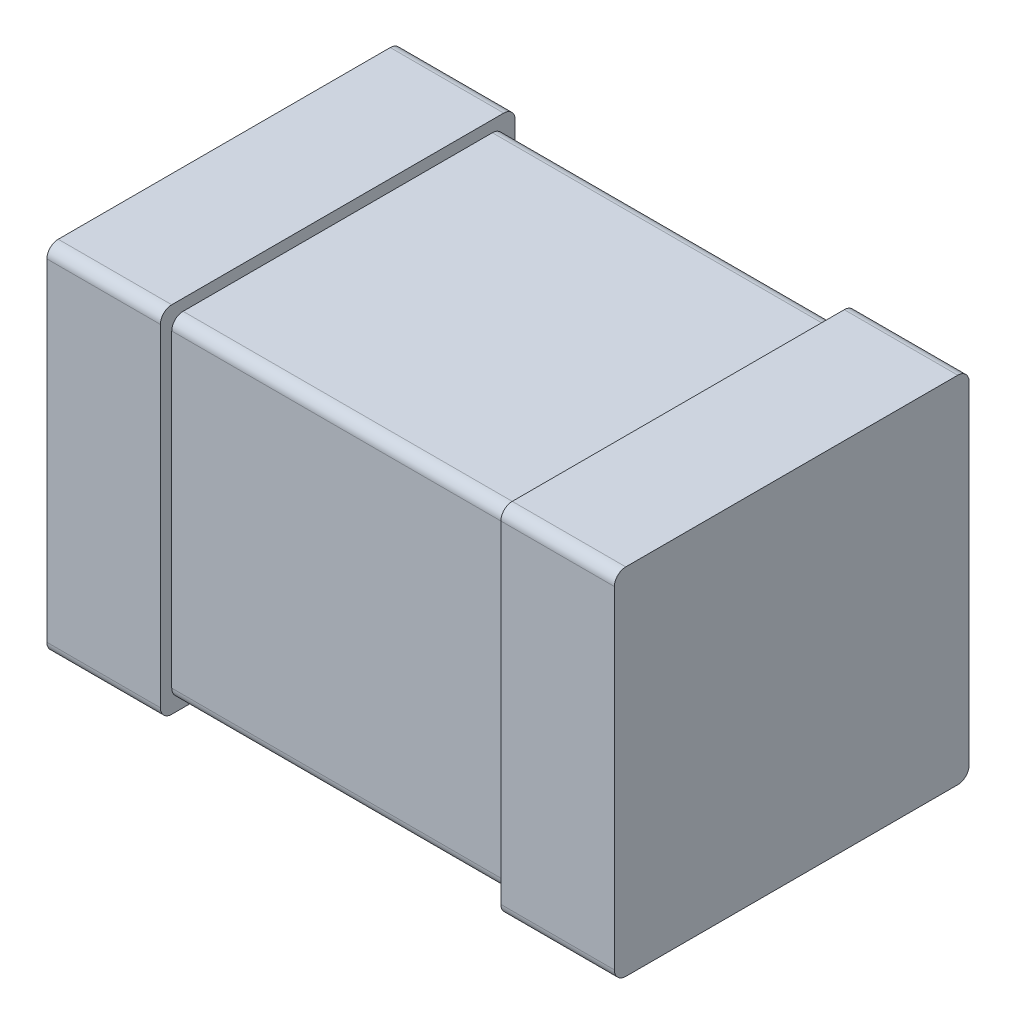
ISO-10303-21;
HEADER;
FILE_DESCRIPTION(('STEP AP214'),'2;1');
FILE_NAME('part.step','',(''),(''),'','','');
FILE_SCHEMA(('AUTOMOTIVE_DESIGN { 1 0 10303 214 1 1 1 1 }'));
ENDSEC;
DATA;
#1=APPLICATION_CONTEXT('core data for automotive mechanical design processes');
#2=APPLICATION_PROTOCOL_DEFINITION('international standard','automotive_design',2000,#1);
#3=PRODUCT_CONTEXT('',#1,'mechanical');
#4=PRODUCT('Part','Part','',(#3));
#5=PRODUCT_RELATED_PRODUCT_CATEGORY('part','',(#4));
#6=PRODUCT_DEFINITION_FORMATION('','',#4);
#7=PRODUCT_DEFINITION_CONTEXT('part definition',#1,'design');
#8=PRODUCT_DEFINITION('design','',#6,#7);
#9=PRODUCT_DEFINITION_SHAPE('','',#8);
#10=(LENGTH_UNIT() NAMED_UNIT(*) SI_UNIT(.MILLI.,.METRE.));
#11=(NAMED_UNIT(*) PLANE_ANGLE_UNIT() SI_UNIT($,.RADIAN.));
#12=(NAMED_UNIT(*) SI_UNIT($,.STERADIAN.) SOLID_ANGLE_UNIT());
#13=UNCERTAINTY_MEASURE_WITH_UNIT(LENGTH_MEASURE(1.E-05),#10,'distance_accuracy_value','');
#14=(GEOMETRIC_REPRESENTATION_CONTEXT(3) GLOBAL_UNCERTAINTY_ASSIGNED_CONTEXT((#13)) GLOBAL_UNIT_ASSIGNED_CONTEXT((#10,
#11,#12)) REPRESENTATION_CONTEXT('',''));
#15=CARTESIAN_POINT('',(0.,0.,0.));
#16=DIRECTION('',(0.,0.,1.));
#17=DIRECTION('',(1.,0.,0.));
#18=AXIS2_PLACEMENT_3D('',#15,#16,#17);
#19=CARTESIAN_POINT('',(-1.,-0.625,0.));
#20=DIRECTION('',(1.,0.,0.));
#21=DIRECTION('',(0.,1.,0.));
#22=AXIS2_PLACEMENT_3D('',#19,#20,#21);
#23=PLANE('',#22);
#24=CARTESIAN_POINT('',(-1.,-0.585,1.21));
#25=DIRECTION('',(-1.,0.,0.));
#26=DIRECTION('',(0.,0.,1.));
#27=AXIS2_PLACEMENT_3D('',#24,#25,#26);
#28=CIRCLE('',#27,0.04);
#29=CARTESIAN_POINT('',(-1.,-0.625,1.21));
#30=VERTEX_POINT('',#29);
#31=CARTESIAN_POINT('',(-1.,-0.585,1.25));
#32=VERTEX_POINT('',#31);
#33=EDGE_CURVE('E11',#30,#32,#28,.T.);
#34=ORIENTED_EDGE('',*,*,#33,.T.);
#35=DIRECTION('',(0.,1.,0.));
#36=VECTOR('',#35,1.);
#37=CARTESIAN_POINT('',(-1.,-0.625,1.25));
#38=LINE('',#37,#36);
#39=CARTESIAN_POINT('',(-1.,0.585,1.25));
#40=VERTEX_POINT('',#39);
#41=EDGE_CURVE('E27',#32,#40,#38,.T.);
#42=ORIENTED_EDGE('',*,*,#41,.T.);
#43=CARTESIAN_POINT('',(-1.,0.585,1.21));
#44=DIRECTION('',(1.,0.,0.));
#45=DIRECTION('',(0.,0.,1.));
#46=AXIS2_PLACEMENT_3D('',#43,#44,#45);
#47=CIRCLE('',#46,0.04);
#48=CARTESIAN_POINT('',(-1.,0.625,1.21));
#49=VERTEX_POINT('',#48);
#50=EDGE_CURVE('E312',#49,#40,#47,.T.);
#51=ORIENTED_EDGE('',*,*,#50,.F.);
#52=DIRECTION('',(0.,0.,1.));
#53=VECTOR('',#52,1.);
#54=CARTESIAN_POINT('',(-1.,0.625,0.));
#55=LINE('',#54,#53);
#56=CARTESIAN_POINT('',(-1.,0.625,0.04));
#57=VERTEX_POINT('',#56);
#58=EDGE_CURVE('E278',#57,#49,#55,.T.);
#59=ORIENTED_EDGE('',*,*,#58,.F.);
#60=CARTESIAN_POINT('',(-1.,0.585,0.04));
#61=DIRECTION('',(-1.,0.,0.));
#62=DIRECTION('',(0.,0.,1.));
#63=AXIS2_PLACEMENT_3D('',#60,#61,#62);
#64=CIRCLE('',#63,0.04);
#65=CARTESIAN_POINT('',(-1.,0.585,0.));
#66=VERTEX_POINT('',#65);
#67=EDGE_CURVE('E328',#57,#66,#64,.T.);
#68=ORIENTED_EDGE('',*,*,#67,.T.);
#69=DIRECTION('',(0.,1.,0.));
#70=VECTOR('',#69,1.);
#71=CARTESIAN_POINT('',(-1.,-0.625,0.));
#72=LINE('',#71,#70);
#73=CARTESIAN_POINT('',(-1.,-0.585,0.));
#74=VERTEX_POINT('',#73);
#75=EDGE_CURVE('E304',#74,#66,#72,.T.);
#76=ORIENTED_EDGE('',*,*,#75,.F.);
#77=CARTESIAN_POINT('',(-1.,-0.585,0.04));
#78=DIRECTION('',(1.,0.,0.));
#79=DIRECTION('',(0.,0.,1.));
#80=AXIS2_PLACEMENT_3D('',#77,#78,#79);
#81=CIRCLE('',#80,0.04);
#82=CARTESIAN_POINT('',(-1.,-0.625,0.04));
#83=VERTEX_POINT('',#82);
#84=EDGE_CURVE('E248',#83,#74,#81,.T.);
#85=ORIENTED_EDGE('',*,*,#84,.F.);
#86=DIRECTION('',(0.,0.,1.));
#87=VECTOR('',#86,1.);
#88=CARTESIAN_POINT('',(-1.,-0.625,0.));
#89=LINE('',#88,#87);
#90=EDGE_CURVE('E231',#83,#30,#89,.T.);
#91=ORIENTED_EDGE('',*,*,#90,.T.);
#92=EDGE_LOOP('',(#34,#42,#51,#59,#68,#76,#85,#91));
#93=FACE_BOUND('',#92,.T.);
#94=ADVANCED_FACE('F16',(#93),#23,.F.);
#95=CARTESIAN_POINT('',(-1.,-0.625,0.));
#96=DIRECTION('',(0.,1.,0.));
#97=DIRECTION('',(1.,0.,0.));
#98=AXIS2_PLACEMENT_3D('',#95,#96,#97);
#99=PLANE('',#98);
#100=DIRECTION('',(1.,0.,0.));
#101=VECTOR('',#100,1.);
#102=CARTESIAN_POINT('',(-1.,-0.625,1.21));
#103=LINE('',#102,#101);
#104=CARTESIAN_POINT('',(-0.6,-0.625,1.21));
#105=VERTEX_POINT('',#104);
#106=EDGE_CURVE('E239',#30,#105,#103,.T.);
#107=ORIENTED_EDGE('',*,*,#106,.F.);
#108=ORIENTED_EDGE('',*,*,#90,.F.);
#109=DIRECTION('',(1.,0.,0.));
#110=VECTOR('',#109,1.);
#111=CARTESIAN_POINT('',(-1.,-0.625,0.04));
#112=LINE('',#111,#110);
#113=CARTESIAN_POINT('',(-0.6,-0.625,0.04));
#114=VERTEX_POINT('',#113);
#115=EDGE_CURVE('E228',#83,#114,#112,.T.);
#116=ORIENTED_EDGE('',*,*,#115,.T.);
#117=DIRECTION('',(0.,0.,1.));
#118=VECTOR('',#117,1.);
#119=CARTESIAN_POINT('',(-0.6,-0.625,0.));
#120=LINE('',#119,#118);
#121=EDGE_CURVE('E232',#114,#105,#120,.T.);
#122=ORIENTED_EDGE('',*,*,#121,.T.);
#123=EDGE_LOOP('',(#107,#108,#116,#122));
#124=FACE_BOUND('',#123,.T.);
#125=ADVANCED_FACE('F553',(#124),#99,.F.);
#126=CARTESIAN_POINT('',(-1.,-0.585,0.04));
#127=DIRECTION('',(1.,0.,0.));
#128=DIRECTION('',(0.,-1.,0.));
#129=AXIS2_PLACEMENT_3D('',#126,#127,#128);
#130=CYLINDRICAL_SURFACE('',#129,0.04);
#131=ORIENTED_EDGE('',*,*,#84,.T.);
#132=DIRECTION('',(1.,0.,0.));
#133=VECTOR('',#132,1.);
#134=CARTESIAN_POINT('',(-1.,-0.585,0.));
#135=LINE('',#134,#133);
#136=CARTESIAN_POINT('',(-0.6,-0.585,0.));
#137=VERTEX_POINT('',#136);
#138=EDGE_CURVE('E243',#74,#137,#135,.T.);
#139=ORIENTED_EDGE('',*,*,#138,.T.);
#140=CARTESIAN_POINT('',(-0.6,-0.585,0.04));
#141=DIRECTION('',(1.,0.,0.));
#142=DIRECTION('',(0.,0.,1.));
#143=AXIS2_PLACEMENT_3D('',#140,#141,#142);
#144=CIRCLE('',#143,0.04);
#145=EDGE_CURVE('E279',#114,#137,#144,.T.);
#146=ORIENTED_EDGE('',*,*,#145,.F.);
#147=ORIENTED_EDGE('',*,*,#115,.F.);
#148=EDGE_LOOP('',(#131,#139,#146,#147));
#149=FACE_BOUND('',#148,.T.);
#150=ADVANCED_FACE('F589',(#149),#130,.T.);
#151=CARTESIAN_POINT('',(-1.,-0.585,1.21));
#152=DIRECTION('',(1.,0.,0.));
#153=DIRECTION('',(0.,-1.,0.));
#154=AXIS2_PLACEMENT_3D('',#151,#152,#153);
#155=CYLINDRICAL_SURFACE('',#154,0.04);
#156=ORIENTED_EDGE('',*,*,#106,.T.);
#157=CARTESIAN_POINT('',(-0.6,-0.585,1.21));
#158=DIRECTION('',(-1.,0.,0.));
#159=DIRECTION('',(0.,0.,1.));
#160=AXIS2_PLACEMENT_3D('',#157,#158,#159);
#161=CIRCLE('',#160,0.04);
#162=CARTESIAN_POINT('',(-0.6,-0.585,1.25));
#163=VERTEX_POINT('',#162);
#164=EDGE_CURVE('E244',#105,#163,#161,.T.);
#165=ORIENTED_EDGE('',*,*,#164,.T.);
#166=DIRECTION('',(1.,0.,0.));
#167=VECTOR('',#166,1.);
#168=CARTESIAN_POINT('',(-1.,-0.585,1.25));
#169=LINE('',#168,#167);
#170=EDGE_CURVE('E292',#32,#163,#169,.T.);
#171=ORIENTED_EDGE('',*,*,#170,.F.);
#172=ORIENTED_EDGE('',*,*,#33,.F.);
#173=EDGE_LOOP('',(#156,#165,#171,#172));
#174=FACE_BOUND('',#173,.T.);
#175=ADVANCED_FACE('F593',(#174),#155,.T.);
#176=CARTESIAN_POINT('',(-1.,-0.625,0.));
#177=DIRECTION('',(0.,0.,1.));
#178=DIRECTION('',(1.,0.,0.));
#179=AXIS2_PLACEMENT_3D('',#176,#177,#178);
#180=PLANE('',#179);
#181=DIRECTION('',(1.,0.,0.));
#182=VECTOR('',#181,1.);
#183=CARTESIAN_POINT('',(-1.,0.585,0.));
#184=LINE('',#183,#182);
#185=CARTESIAN_POINT('',(-0.6,0.585,0.));
#186=VERTEX_POINT('',#185);
#187=EDGE_CURVE('E335',#66,#186,#184,.T.);
#188=ORIENTED_EDGE('',*,*,#187,.T.);
#189=DIRECTION('',(0.,1.,0.));
#190=VECTOR('',#189,1.);
#191=CARTESIAN_POINT('',(-0.6,-0.625,0.));
#192=LINE('',#191,#190);
#193=EDGE_CURVE('E261',#137,#186,#192,.T.);
#194=ORIENTED_EDGE('',*,*,#193,.F.);
#195=ORIENTED_EDGE('',*,*,#138,.F.);
#196=ORIENTED_EDGE('',*,*,#75,.T.);
#197=EDGE_LOOP('',(#188,#194,#195,#196));
#198=FACE_BOUND('',#197,.T.);
#199=ADVANCED_FACE('F690',(#198),#180,.F.);
#200=CARTESIAN_POINT('',(-1.,-0.625,1.25));
#201=DIRECTION('',(0.,0.,1.));
#202=DIRECTION('',(1.,0.,0.));
#203=AXIS2_PLACEMENT_3D('',#200,#201,#202);
#204=PLANE('',#203);
#205=ORIENTED_EDGE('',*,*,#41,.F.);
#206=ORIENTED_EDGE('',*,*,#170,.T.);
#207=DIRECTION('',(0.,1.,0.));
#208=VECTOR('',#207,1.);
#209=CARTESIAN_POINT('',(-0.6,-0.625,1.25));
#210=LINE('',#209,#208);
#211=CARTESIAN_POINT('',(-0.6,0.585,1.25));
#212=VERTEX_POINT('',#211);
#213=EDGE_CURVE('E288',#163,#212,#210,.T.);
#214=ORIENTED_EDGE('',*,*,#213,.T.);
#215=DIRECTION('',(1.,0.,0.));
#216=VECTOR('',#215,1.);
#217=CARTESIAN_POINT('',(-1.,0.585,1.25));
#218=LINE('',#217,#216);
#219=EDGE_CURVE('E316',#40,#212,#218,.T.);
#220=ORIENTED_EDGE('',*,*,#219,.F.);
#221=EDGE_LOOP('',(#205,#206,#214,#220));
#222=FACE_BOUND('',#221,.T.);
#223=ADVANCED_FACE('F378',(#222),#204,.T.);
#224=CARTESIAN_POINT('',(-1.,0.585,0.04));
#225=DIRECTION('',(1.,0.,0.));
#226=DIRECTION('',(0.,1.,0.));
#227=AXIS2_PLACEMENT_3D('',#224,#225,#226);
#228=CYLINDRICAL_SURFACE('',#227,0.04);
#229=DIRECTION('',(1.,0.,0.));
#230=VECTOR('',#229,1.);
#231=CARTESIAN_POINT('',(-1.,0.625,0.04));
#232=LINE('',#231,#230);
#233=CARTESIAN_POINT('',(-0.6,0.625,0.04));
#234=VERTEX_POINT('',#233);
#235=EDGE_CURVE('E293',#57,#234,#232,.T.);
#236=ORIENTED_EDGE('',*,*,#235,.T.);
#237=CARTESIAN_POINT('',(-0.6,0.585,0.04));
#238=DIRECTION('',(-1.,0.,0.));
#239=DIRECTION('',(0.,0.,1.));
#240=AXIS2_PLACEMENT_3D('',#237,#238,#239);
#241=CIRCLE('',#240,0.04);
#242=EDGE_CURVE('E315',#234,#186,#241,.T.);
#243=ORIENTED_EDGE('',*,*,#242,.T.);
#244=ORIENTED_EDGE('',*,*,#187,.F.);
#245=ORIENTED_EDGE('',*,*,#67,.F.);
#246=EDGE_LOOP('',(#236,#243,#244,#245));
#247=FACE_BOUND('',#246,.T.);
#248=ADVANCED_FACE('F402',(#247),#228,.T.);
#249=CARTESIAN_POINT('',(-1.,0.585,1.21));
#250=DIRECTION('',(1.,0.,0.));
#251=DIRECTION('',(0.,1.,0.));
#252=AXIS2_PLACEMENT_3D('',#249,#250,#251);
#253=CYLINDRICAL_SURFACE('',#252,0.04);
#254=ORIENTED_EDGE('',*,*,#50,.T.);
#255=ORIENTED_EDGE('',*,*,#219,.T.);
#256=CARTESIAN_POINT('',(-0.6,0.585,1.21));
#257=DIRECTION('',(1.,0.,0.));
#258=DIRECTION('',(0.,0.,1.));
#259=AXIS2_PLACEMENT_3D('',#256,#257,#258);
#260=CIRCLE('',#259,0.04);
#261=CARTESIAN_POINT('',(-0.6,0.625,1.21));
#262=VERTEX_POINT('',#261);
#263=EDGE_CURVE('E262',#262,#212,#260,.T.);
#264=ORIENTED_EDGE('',*,*,#263,.F.);
#265=DIRECTION('',(1.,0.,0.));
#266=VECTOR('',#265,1.);
#267=CARTESIAN_POINT('',(-1.,0.625,1.21));
#268=LINE('',#267,#266);
#269=EDGE_CURVE('E274',#49,#262,#268,.T.);
#270=ORIENTED_EDGE('',*,*,#269,.F.);
#271=EDGE_LOOP('',(#254,#255,#264,#270));
#272=FACE_BOUND('',#271,.T.);
#273=ADVANCED_FACE('F383',(#272),#253,.T.);
#274=CARTESIAN_POINT('',(-1.,0.625,0.));
#275=DIRECTION('',(0.,1.,0.));
#276=DIRECTION('',(1.,0.,0.));
#277=AXIS2_PLACEMENT_3D('',#274,#275,#276);
#278=PLANE('',#277);
#279=DIRECTION('',(0.,0.,1.));
#280=VECTOR('',#279,1.);
#281=CARTESIAN_POINT('',(-0.6,0.625,0.));
#282=LINE('',#281,#280);
#283=EDGE_CURVE('E257',#234,#262,#282,.T.);
#284=ORIENTED_EDGE('',*,*,#283,.F.);
#285=ORIENTED_EDGE('',*,*,#235,.F.);
#286=ORIENTED_EDGE('',*,*,#58,.T.);
#287=ORIENTED_EDGE('',*,*,#269,.T.);
#288=EDGE_LOOP('',(#284,#285,#286,#287));
#289=FACE_BOUND('',#288,.T.);
#290=ADVANCED_FACE('F18',(#289),#278,.T.);
#291=CARTESIAN_POINT('',(-0.6,-0.625,0.));
#292=DIRECTION('',(1.,0.,0.));
#293=DIRECTION('',(0.,1.,0.));
#294=AXIS2_PLACEMENT_3D('',#291,#292,#293);
#295=PLANE('',#294);
#296=ORIENTED_EDGE('',*,*,#121,.F.);
#297=ORIENTED_EDGE('',*,*,#145,.T.);
#298=ORIENTED_EDGE('',*,*,#193,.T.);
#299=ORIENTED_EDGE('',*,*,#242,.F.);
#300=ORIENTED_EDGE('',*,*,#283,.T.);
#301=ORIENTED_EDGE('',*,*,#263,.T.);
#302=ORIENTED_EDGE('',*,*,#213,.F.);
#303=ORIENTED_EDGE('',*,*,#164,.F.);
#304=EDGE_LOOP('',(#296,#297,#298,#299,#300,#301,#302,#303));
#305=FACE_BOUND('',#304,.T.);
#306=CARTESIAN_POINT('',(-0.6,-0.545,0.08));
#307=DIRECTION('',(1.,0.,0.));
#308=DIRECTION('',(0.,0.,1.));
#309=AXIS2_PLACEMENT_3D('',#306,#307,#308);
#310=CIRCLE('',#309,0.04);
#311=CARTESIAN_POINT('',(-0.6,-0.585,0.08));
#312=VERTEX_POINT('',#311);
#313=CARTESIAN_POINT('',(-0.6,-0.545,0.04));
#314=VERTEX_POINT('',#313);
#315=EDGE_CURVE('E300',#312,#314,#310,.T.);
#316=ORIENTED_EDGE('',*,*,#315,.F.);
#317=DIRECTION('',(0.,0.,1.));
#318=VECTOR('',#317,1.);
#319=CARTESIAN_POINT('',(-0.6,-0.585,0.04));
#320=LINE('',#319,#318);
#321=CARTESIAN_POINT('',(-0.6,-0.585,1.17));
#322=VERTEX_POINT('',#321);
#323=EDGE_CURVE('E488',#312,#322,#320,.T.);
#324=ORIENTED_EDGE('',*,*,#323,.T.);
#325=CARTESIAN_POINT('',(-0.6,-0.545,1.17));
#326=DIRECTION('',(-1.,0.,0.));
#327=DIRECTION('',(0.,0.,1.));
#328=AXIS2_PLACEMENT_3D('',#325,#326,#327);
#329=CIRCLE('',#328,0.04);
#330=CARTESIAN_POINT('',(-0.6,-0.545,1.21));
#331=VERTEX_POINT('',#330);
#332=EDGE_CURVE('E485',#322,#331,#329,.T.);
#333=ORIENTED_EDGE('',*,*,#332,.T.);
#334=DIRECTION('',(0.,1.,0.));
#335=VECTOR('',#334,1.);
#336=CARTESIAN_POINT('',(-0.6,-0.585,1.21));
#337=LINE('',#336,#335);
#338=CARTESIAN_POINT('',(-0.6,0.545,1.21));
#339=VERTEX_POINT('',#338);
#340=EDGE_CURVE('E367',#331,#339,#337,.T.);
#341=ORIENTED_EDGE('',*,*,#340,.T.);
#342=CARTESIAN_POINT('',(-0.6,0.545,1.17));
#343=DIRECTION('',(1.,0.,0.));
#344=DIRECTION('',(0.,0.,1.));
#345=AXIS2_PLACEMENT_3D('',#342,#343,#344);
#346=CIRCLE('',#345,0.04);
#347=CARTESIAN_POINT('',(-0.6,0.585,1.17));
#348=VERTEX_POINT('',#347);
#349=EDGE_CURVE('E238',#348,#339,#346,.T.);
#350=ORIENTED_EDGE('',*,*,#349,.F.);
#351=DIRECTION('',(0.,0.,1.));
#352=VECTOR('',#351,1.);
#353=CARTESIAN_POINT('',(-0.6,0.585,0.04));
#354=LINE('',#353,#352);
#355=CARTESIAN_POINT('',(-0.6,0.585,0.08));
#356=VERTEX_POINT('',#355);
#357=EDGE_CURVE('E237',#356,#348,#354,.T.);
#358=ORIENTED_EDGE('',*,*,#357,.F.);
#359=CARTESIAN_POINT('',(-0.6,0.545,0.08));
#360=DIRECTION('',(-1.,0.,0.));
#361=DIRECTION('',(0.,0.,1.));
#362=AXIS2_PLACEMENT_3D('',#359,#360,#361);
#363=CIRCLE('',#362,0.04);
#364=CARTESIAN_POINT('',(-0.6,0.545,0.04));
#365=VERTEX_POINT('',#364);
#366=EDGE_CURVE('E226',#356,#365,#363,.T.);
#367=ORIENTED_EDGE('',*,*,#366,.T.);
#368=DIRECTION('',(0.,1.,0.));
#369=VECTOR('',#368,1.);
#370=CARTESIAN_POINT('',(-0.6,-0.585,0.04));
#371=LINE('',#370,#369);
#372=EDGE_CURVE('E58',#314,#365,#371,.T.);
#373=ORIENTED_EDGE('',*,*,#372,.F.);
#374=EDGE_LOOP('',(#316,#324,#333,#341,#350,#358,#367,#373));
#375=FACE_BOUND('',#374,.T.);
#376=ADVANCED_FACE('F391',(#305,#375),#295,.T.);
#377=CARTESIAN_POINT('',(-0.6,-0.545,0.08));
#378=DIRECTION('',(1.,0.,0.));
#379=DIRECTION('',(0.,-1.,0.));
#380=AXIS2_PLACEMENT_3D('',#377,#378,#379);
#381=CYLINDRICAL_SURFACE('',#380,0.04);
#382=ORIENTED_EDGE('',*,*,#315,.T.);
#383=DIRECTION('',(1.,0.,0.));
#384=VECTOR('',#383,1.);
#385=CARTESIAN_POINT('',(-0.6,-0.545,0.04));
#386=LINE('',#385,#384);
#387=CARTESIAN_POINT('',(0.6,-0.545,0.04));
#388=VERTEX_POINT('',#387);
#389=EDGE_CURVE('E297',#314,#388,#386,.T.);
#390=ORIENTED_EDGE('',*,*,#389,.T.);
#391=CARTESIAN_POINT('',(0.6,-0.545,0.08));
#392=DIRECTION('',(1.,0.,0.));
#393=DIRECTION('',(0.,0.,1.));
#394=AXIS2_PLACEMENT_3D('',#391,#392,#393);
#395=CIRCLE('',#394,0.04);
#396=CARTESIAN_POINT('',(0.6,-0.585,0.08));
#397=VERTEX_POINT('',#396);
#398=EDGE_CURVE('E74',#397,#388,#395,.T.);
#399=ORIENTED_EDGE('',*,*,#398,.F.);
#400=DIRECTION('',(1.,0.,0.));
#401=VECTOR('',#400,1.);
#402=CARTESIAN_POINT('',(-0.6,-0.585,0.08));
#403=LINE('',#402,#401);
#404=EDGE_CURVE('E268',#312,#397,#403,.T.);
#405=ORIENTED_EDGE('',*,*,#404,.F.);
#406=EDGE_LOOP('',(#382,#390,#399,#405));
#407=FACE_BOUND('',#406,.T.);
#408=ADVANCED_FACE('F672',(#407),#381,.T.);
#409=CARTESIAN_POINT('',(-0.6,-0.585,0.04));
#410=DIRECTION('',(0.,0.,1.));
#411=DIRECTION('',(1.,0.,0.));
#412=AXIS2_PLACEMENT_3D('',#409,#410,#411);
#413=PLANE('',#412);
#414=DIRECTION('',(1.,0.,0.));
#415=VECTOR('',#414,1.);
#416=CARTESIAN_POINT('',(-0.6,0.545,0.04));
#417=LINE('',#416,#415);
#418=CARTESIAN_POINT('',(0.6,0.545,0.04));
#419=VERTEX_POINT('',#418);
#420=EDGE_CURVE('E301',#365,#419,#417,.T.);
#421=ORIENTED_EDGE('',*,*,#420,.T.);
#422=DIRECTION('',(0.,1.,0.));
#423=VECTOR('',#422,1.);
#424=CARTESIAN_POINT('',(0.6,-0.585,0.04));
#425=LINE('',#424,#423);
#426=EDGE_CURVE('E196',#388,#419,#425,.T.);
#427=ORIENTED_EDGE('',*,*,#426,.F.);
#428=ORIENTED_EDGE('',*,*,#389,.F.);
#429=ORIENTED_EDGE('',*,*,#372,.T.);
#430=EDGE_LOOP('',(#421,#427,#428,#429));
#431=FACE_BOUND('',#430,.T.);
#432=ADVANCED_FACE('F512',(#431),#413,.F.);
#433=CARTESIAN_POINT('',(-0.6,0.545,0.08));
#434=DIRECTION('',(1.,0.,0.));
#435=DIRECTION('',(0.,1.,0.));
#436=AXIS2_PLACEMENT_3D('',#433,#434,#435);
#437=CYLINDRICAL_SURFACE('',#436,0.04);
#438=DIRECTION('',(1.,0.,0.));
#439=VECTOR('',#438,1.);
#440=CARTESIAN_POINT('',(-0.6,0.585,0.08));
#441=LINE('',#440,#439);
#442=CARTESIAN_POINT('',(0.6,0.585,0.08));
#443=VERTEX_POINT('',#442);
#444=EDGE_CURVE('E369',#356,#443,#441,.T.);
#445=ORIENTED_EDGE('',*,*,#444,.T.);
#446=CARTESIAN_POINT('',(0.6,0.545,0.08));
#447=DIRECTION('',(-1.,0.,0.));
#448=DIRECTION('',(0.,0.,1.));
#449=AXIS2_PLACEMENT_3D('',#446,#447,#448);
#450=CIRCLE('',#449,0.04);
#451=EDGE_CURVE('E287',#443,#419,#450,.T.);
#452=ORIENTED_EDGE('',*,*,#451,.T.);
#453=ORIENTED_EDGE('',*,*,#420,.F.);
#454=ORIENTED_EDGE('',*,*,#366,.F.);
#455=EDGE_LOOP('',(#445,#452,#453,#454));
#456=FACE_BOUND('',#455,.T.);
#457=ADVANCED_FACE('F515',(#456),#437,.T.);
#458=CARTESIAN_POINT('',(-0.6,0.585,0.04));
#459=DIRECTION('',(0.,1.,0.));
#460=DIRECTION('',(1.,0.,0.));
#461=AXIS2_PLACEMENT_3D('',#458,#459,#460);
#462=PLANE('',#461);
#463=DIRECTION('',(0.,0.,1.));
#464=VECTOR('',#463,1.);
#465=CARTESIAN_POINT('',(0.6,0.585,0.04));
#466=LINE('',#465,#464);
#467=CARTESIAN_POINT('',(0.6,0.585,1.17));
#468=VERTEX_POINT('',#467);
#469=EDGE_CURVE('E308',#443,#468,#466,.T.);
#470=ORIENTED_EDGE('',*,*,#469,.F.);
#471=ORIENTED_EDGE('',*,*,#444,.F.);
#472=ORIENTED_EDGE('',*,*,#357,.T.);
#473=DIRECTION('',(1.,0.,0.));
#474=VECTOR('',#473,1.);
#475=CARTESIAN_POINT('',(-0.6,0.585,1.17));
#476=LINE('',#475,#474);
#477=EDGE_CURVE('E233',#348,#468,#476,.T.);
#478=ORIENTED_EDGE('',*,*,#477,.T.);
#479=EDGE_LOOP('',(#470,#471,#472,#478));
#480=FACE_BOUND('',#479,.T.);
#481=ADVANCED_FACE('F521',(#480),#462,.T.);
#482=CARTESIAN_POINT('',(-0.6,0.545,1.17));
#483=DIRECTION('',(1.,0.,0.));
#484=DIRECTION('',(0.,1.,0.));
#485=AXIS2_PLACEMENT_3D('',#482,#483,#484);
#486=CYLINDRICAL_SURFACE('',#485,0.04);
#487=ORIENTED_EDGE('',*,*,#349,.T.);
#488=DIRECTION('',(1.,0.,0.));
#489=VECTOR('',#488,1.);
#490=CARTESIAN_POINT('',(-0.6,0.545,1.21));
#491=LINE('',#490,#489);
#492=CARTESIAN_POINT('',(0.6,0.545,1.21));
#493=VERTEX_POINT('',#492);
#494=EDGE_CURVE('E280',#339,#493,#491,.T.);
#495=ORIENTED_EDGE('',*,*,#494,.T.);
#496=CARTESIAN_POINT('',(0.6,0.545,1.17));
#497=DIRECTION('',(1.,0.,0.));
#498=DIRECTION('',(0.,0.,1.));
#499=AXIS2_PLACEMENT_3D('',#496,#497,#498);
#500=CIRCLE('',#499,0.04);
#501=EDGE_CURVE('E305',#468,#493,#500,.T.);
#502=ORIENTED_EDGE('',*,*,#501,.F.);
#503=ORIENTED_EDGE('',*,*,#477,.F.);
#504=EDGE_LOOP('',(#487,#495,#502,#503));
#505=FACE_BOUND('',#504,.T.);
#506=ADVANCED_FACE('F527',(#505),#486,.T.);
#507=CARTESIAN_POINT('',(-0.6,-0.585,1.21));
#508=DIRECTION('',(0.,0.,1.));
#509=DIRECTION('',(1.,0.,0.));
#510=AXIS2_PLACEMENT_3D('',#507,#508,#509);
#511=PLANE('',#510);
#512=ORIENTED_EDGE('',*,*,#340,.F.);
#513=DIRECTION('',(1.,0.,0.));
#514=VECTOR('',#513,1.);
#515=CARTESIAN_POINT('',(-0.6,-0.545,1.21));
#516=LINE('',#515,#514);
#517=CARTESIAN_POINT('',(0.6,-0.545,1.21));
#518=VERTEX_POINT('',#517);
#519=EDGE_CURVE('E267',#331,#518,#516,.T.);
#520=ORIENTED_EDGE('',*,*,#519,.T.);
#521=DIRECTION('',(0.,1.,0.));
#522=VECTOR('',#521,1.);
#523=CARTESIAN_POINT('',(0.6,-0.585,1.21));
#524=LINE('',#523,#522);
#525=EDGE_CURVE('E263',#518,#493,#524,.T.);
#526=ORIENTED_EDGE('',*,*,#525,.T.);
#527=ORIENTED_EDGE('',*,*,#494,.F.);
#528=EDGE_LOOP('',(#512,#520,#526,#527));
#529=FACE_BOUND('',#528,.T.);
#530=ADVANCED_FACE('F532',(#529),#511,.T.);
#531=CARTESIAN_POINT('',(-0.6,-0.545,1.17));
#532=DIRECTION('',(1.,0.,0.));
#533=DIRECTION('',(0.,-1.,0.));
#534=AXIS2_PLACEMENT_3D('',#531,#532,#533);
#535=CYLINDRICAL_SURFACE('',#534,0.04);
#536=DIRECTION('',(1.,0.,0.));
#537=VECTOR('',#536,1.);
#538=CARTESIAN_POINT('',(-0.6,-0.585,1.17));
#539=LINE('',#538,#537);
#540=CARTESIAN_POINT('',(0.6,-0.585,1.17));
#541=VERTEX_POINT('',#540);
#542=EDGE_CURVE('E20',#322,#541,#539,.T.);
#543=ORIENTED_EDGE('',*,*,#542,.T.);
#544=CARTESIAN_POINT('',(0.6,-0.545,1.17));
#545=DIRECTION('',(-1.,0.,0.));
#546=DIRECTION('',(0.,0.,1.));
#547=AXIS2_PLACEMENT_3D('',#544,#545,#546);
#548=CIRCLE('',#547,0.04);
#549=EDGE_CURVE('E272',#541,#518,#548,.T.);
#550=ORIENTED_EDGE('',*,*,#549,.T.);
#551=ORIENTED_EDGE('',*,*,#519,.F.);
#552=ORIENTED_EDGE('',*,*,#332,.F.);
#553=EDGE_LOOP('',(#543,#550,#551,#552));
#554=FACE_BOUND('',#553,.T.);
#555=ADVANCED_FACE('F540',(#554),#535,.T.);
#556=CARTESIAN_POINT('',(-0.6,-0.585,0.04));
#557=DIRECTION('',(0.,1.,0.));
#558=DIRECTION('',(1.,0.,0.));
#559=AXIS2_PLACEMENT_3D('',#556,#557,#558);
#560=PLANE('',#559);
#561=ORIENTED_EDGE('',*,*,#542,.F.);
#562=ORIENTED_EDGE('',*,*,#323,.F.);
#563=ORIENTED_EDGE('',*,*,#404,.T.);
#564=DIRECTION('',(0.,0.,1.));
#565=VECTOR('',#564,1.);
#566=CARTESIAN_POINT('',(0.6,-0.585,0.04));
#567=LINE('',#566,#565);
#568=EDGE_CURVE('E273',#397,#541,#567,.T.);
#569=ORIENTED_EDGE('',*,*,#568,.T.);
#570=EDGE_LOOP('',(#561,#562,#563,#569));
#571=FACE_BOUND('',#570,.T.);
#572=ADVANCED_FACE('F564',(#571),#560,.F.);
#573=CARTESIAN_POINT('',(0.6,-0.625,0.));
#574=DIRECTION('',(1.,0.,0.));
#575=DIRECTION('',(0.,1.,0.));
#576=AXIS2_PLACEMENT_3D('',#573,#574,#575);
#577=PLANE('',#576);
#578=CARTESIAN_POINT('',(0.6,-0.585,1.21));
#579=DIRECTION('',(-1.,0.,0.));
#580=DIRECTION('',(0.,0.,1.));
#581=AXIS2_PLACEMENT_3D('',#578,#579,#580);
#582=CIRCLE('',#581,0.04);
#583=CARTESIAN_POINT('',(0.6,-0.625,1.21));
#584=VERTEX_POINT('',#583);
#585=CARTESIAN_POINT('',(0.6,-0.585,1.25));
#586=VERTEX_POINT('',#585);
#587=EDGE_CURVE('E165',#584,#586,#582,.T.);
#588=ORIENTED_EDGE('',*,*,#587,.T.);
#589=DIRECTION('',(0.,1.,0.));
#590=VECTOR('',#589,1.);
#591=CARTESIAN_POINT('',(0.6,-0.625,1.25));
#592=LINE('',#591,#590);
#593=CARTESIAN_POINT('',(0.6,0.585,1.25));
#594=VERTEX_POINT('',#593);
#595=EDGE_CURVE('E253',#586,#594,#592,.T.);
#596=ORIENTED_EDGE('',*,*,#595,.T.);
#597=CARTESIAN_POINT('',(0.6,0.585,1.21));
#598=DIRECTION('',(1.,0.,0.));
#599=DIRECTION('',(0.,0.,1.));
#600=AXIS2_PLACEMENT_3D('',#597,#598,#599);
#601=CIRCLE('',#600,0.04);
#602=CARTESIAN_POINT('',(0.6,0.625,1.21));
#603=VERTEX_POINT('',#602);
#604=EDGE_CURVE('E347',#603,#594,#601,.T.);
#605=ORIENTED_EDGE('',*,*,#604,.F.);
#606=DIRECTION('',(0.,0.,1.));
#607=VECTOR('',#606,1.);
#608=CARTESIAN_POINT('',(0.6,0.625,0.));
#609=LINE('',#608,#607);
#610=CARTESIAN_POINT('',(0.6,0.625,0.04));
#611=VERTEX_POINT('',#610);
#612=EDGE_CURVE('E200',#611,#603,#609,.T.);
#613=ORIENTED_EDGE('',*,*,#612,.F.);
#614=CARTESIAN_POINT('',(0.6,0.585,0.04));
#615=DIRECTION('',(-1.,0.,0.));
#616=DIRECTION('',(0.,0.,1.));
#617=AXIS2_PLACEMENT_3D('',#614,#615,#616);
#618=CIRCLE('',#617,0.04);
#619=CARTESIAN_POINT('',(0.6,0.585,0.));
#620=VERTEX_POINT('',#619);
#621=EDGE_CURVE('E249',#611,#620,#618,.T.);
#622=ORIENTED_EDGE('',*,*,#621,.T.);
#623=DIRECTION('',(0.,1.,0.));
#624=VECTOR('',#623,1.);
#625=CARTESIAN_POINT('',(0.6,-0.625,0.));
#626=LINE('',#625,#624);
#627=CARTESIAN_POINT('',(0.6,-0.585,0.));
#628=VERTEX_POINT('',#627);
#629=EDGE_CURVE('E193',#628,#620,#626,.T.);
#630=ORIENTED_EDGE('',*,*,#629,.F.);
#631=CARTESIAN_POINT('',(0.6,-0.585,0.04));
#632=DIRECTION('',(1.,0.,0.));
#633=DIRECTION('',(0.,0.,1.));
#634=AXIS2_PLACEMENT_3D('',#631,#632,#633);
#635=CIRCLE('',#634,0.04);
#636=CARTESIAN_POINT('',(0.6,-0.625,0.04));
#637=VERTEX_POINT('',#636);
#638=EDGE_CURVE('E179',#637,#628,#635,.T.);
#639=ORIENTED_EDGE('',*,*,#638,.F.);
#640=DIRECTION('',(0.,0.,1.));
#641=VECTOR('',#640,1.);
#642=CARTESIAN_POINT('',(0.6,-0.625,0.));
#643=LINE('',#642,#641);
#644=EDGE_CURVE('E254',#637,#584,#643,.T.);
#645=ORIENTED_EDGE('',*,*,#644,.T.);
#646=EDGE_LOOP('',(#588,#596,#605,#613,#622,#630,#639,#645));
#647=FACE_BOUND('',#646,.T.);
#648=ORIENTED_EDGE('',*,*,#426,.T.);
#649=ORIENTED_EDGE('',*,*,#451,.F.);
#650=ORIENTED_EDGE('',*,*,#469,.T.);
#651=ORIENTED_EDGE('',*,*,#501,.T.);
#652=ORIENTED_EDGE('',*,*,#525,.F.);
#653=ORIENTED_EDGE('',*,*,#549,.F.);
#654=ORIENTED_EDGE('',*,*,#568,.F.);
#655=ORIENTED_EDGE('',*,*,#398,.T.);
#656=EDGE_LOOP('',(#648,#649,#650,#651,#652,#653,#654,#655));
#657=FACE_BOUND('',#656,.T.);
#658=ADVANCED_FACE('F507',(#647,#657),#577,.F.);
#659=CARTESIAN_POINT('',(0.6,-0.625,0.));
#660=DIRECTION('',(0.,1.,0.));
#661=DIRECTION('',(1.,0.,0.));
#662=AXIS2_PLACEMENT_3D('',#659,#660,#661);
#663=PLANE('',#662);
#664=DIRECTION('',(1.,0.,0.));
#665=VECTOR('',#664,1.);
#666=CARTESIAN_POINT('',(0.6,-0.625,1.21));
#667=LINE('',#666,#665);
#668=CARTESIAN_POINT('',(1.,-0.625,1.21));
#669=VERTEX_POINT('',#668);
#670=EDGE_CURVE('E157',#584,#669,#667,.T.);
#671=ORIENTED_EDGE('',*,*,#670,.F.);
#672=ORIENTED_EDGE('',*,*,#644,.F.);
#673=DIRECTION('',(1.,0.,0.));
#674=VECTOR('',#673,1.);
#675=CARTESIAN_POINT('',(0.6,-0.625,0.04));
#676=LINE('',#675,#674);
#677=CARTESIAN_POINT('',(1.,-0.625,0.04));
#678=VERTEX_POINT('',#677);
#679=EDGE_CURVE('E175',#637,#678,#676,.T.);
#680=ORIENTED_EDGE('',*,*,#679,.T.);
#681=DIRECTION('',(0.,0.,1.));
#682=VECTOR('',#681,1.);
#683=CARTESIAN_POINT('',(1.,-0.625,0.));
#684=LINE('',#683,#682);
#685=EDGE_CURVE('E172',#678,#669,#684,.T.);
#686=ORIENTED_EDGE('',*,*,#685,.T.);
#687=EDGE_LOOP('',(#671,#672,#680,#686));
#688=FACE_BOUND('',#687,.T.);
#689=ADVANCED_FACE('F173',(#688),#663,.F.);
#690=CARTESIAN_POINT('',(0.6,-0.585,0.04));
#691=DIRECTION('',(1.,0.,0.));
#692=DIRECTION('',(0.,-1.,0.));
#693=AXIS2_PLACEMENT_3D('',#690,#691,#692);
#694=CYLINDRICAL_SURFACE('',#693,0.04);
#695=ORIENTED_EDGE('',*,*,#638,.T.);
#696=DIRECTION('',(1.,0.,0.));
#697=VECTOR('',#696,1.);
#698=CARTESIAN_POINT('',(0.6,-0.585,0.));
#699=LINE('',#698,#697);
#700=CARTESIAN_POINT('',(1.,-0.585,0.));
#701=VERTEX_POINT('',#700);
#702=EDGE_CURVE('E169',#628,#701,#699,.T.);
#703=ORIENTED_EDGE('',*,*,#702,.T.);
#704=CARTESIAN_POINT('',(1.,-0.585,0.04));
#705=DIRECTION('',(1.,0.,0.));
#706=DIRECTION('',(0.,0.,1.));
#707=AXIS2_PLACEMENT_3D('',#704,#705,#706);
#708=CIRCLE('',#707,0.04);
#709=EDGE_CURVE('E201',#678,#701,#708,.T.);
#710=ORIENTED_EDGE('',*,*,#709,.F.);
#711=ORIENTED_EDGE('',*,*,#679,.F.);
#712=EDGE_LOOP('',(#695,#703,#710,#711));
#713=FACE_BOUND('',#712,.T.);
#714=ADVANCED_FACE('F602',(#713),#694,.T.);
#715=CARTESIAN_POINT('',(0.6,-0.585,1.21));
#716=DIRECTION('',(1.,0.,0.));
#717=DIRECTION('',(0.,-1.,0.));
#718=AXIS2_PLACEMENT_3D('',#715,#716,#717);
#719=CYLINDRICAL_SURFACE('',#718,0.04);
#720=ORIENTED_EDGE('',*,*,#670,.T.);
#721=CARTESIAN_POINT('',(1.,-0.585,1.21));
#722=DIRECTION('',(-1.,0.,0.));
#723=DIRECTION('',(0.,0.,1.));
#724=AXIS2_PLACEMENT_3D('',#721,#722,#723);
#725=CIRCLE('',#724,0.04);
#726=CARTESIAN_POINT('',(1.,-0.585,1.25));
#727=VERTEX_POINT('',#726);
#728=EDGE_CURVE('E162',#669,#727,#725,.T.);
#729=ORIENTED_EDGE('',*,*,#728,.T.);
#730=DIRECTION('',(1.,0.,0.));
#731=VECTOR('',#730,1.);
#732=CARTESIAN_POINT('',(0.6,-0.585,1.25));
#733=LINE('',#732,#731);
#734=EDGE_CURVE('E500',#586,#727,#733,.T.);
#735=ORIENTED_EDGE('',*,*,#734,.F.);
#736=ORIENTED_EDGE('',*,*,#587,.F.);
#737=EDGE_LOOP('',(#720,#729,#735,#736));
#738=FACE_BOUND('',#737,.T.);
#739=ADVANCED_FACE('F159',(#738),#719,.T.);
#740=CARTESIAN_POINT('',(0.6,-0.625,0.));
#741=DIRECTION('',(0.,0.,1.));
#742=DIRECTION('',(1.,0.,0.));
#743=AXIS2_PLACEMENT_3D('',#740,#741,#742);
#744=PLANE('',#743);
#745=DIRECTION('',(1.,0.,0.));
#746=VECTOR('',#745,1.);
#747=CARTESIAN_POINT('',(0.6,0.585,0.));
#748=LINE('',#747,#746);
#749=CARTESIAN_POINT('',(1.,0.585,0.));
#750=VERTEX_POINT('',#749);
#751=EDGE_CURVE('E186',#620,#750,#748,.T.);
#752=ORIENTED_EDGE('',*,*,#751,.T.);
#753=DIRECTION('',(0.,1.,0.));
#754=VECTOR('',#753,1.);
#755=CARTESIAN_POINT('',(1.,-0.625,0.));
#756=LINE('',#755,#754);
#757=EDGE_CURVE('E214',#701,#750,#756,.T.);
#758=ORIENTED_EDGE('',*,*,#757,.F.);
#759=ORIENTED_EDGE('',*,*,#702,.F.);
#760=ORIENTED_EDGE('',*,*,#629,.T.);
#761=EDGE_LOOP('',(#752,#758,#759,#760));
#762=FACE_BOUND('',#761,.T.);
#763=ADVANCED_FACE('F461',(#762),#744,.F.);
#764=CARTESIAN_POINT('',(0.6,-0.625,1.25));
#765=DIRECTION('',(0.,0.,1.));
#766=DIRECTION('',(1.,0.,0.));
#767=AXIS2_PLACEMENT_3D('',#764,#765,#766);
#768=PLANE('',#767);
#769=ORIENTED_EDGE('',*,*,#595,.F.);
#770=ORIENTED_EDGE('',*,*,#734,.T.);
#771=DIRECTION('',(0.,1.,0.));
#772=VECTOR('',#771,1.);
#773=CARTESIAN_POINT('',(1.,-0.625,1.25));
#774=LINE('',#773,#772);
#775=CARTESIAN_POINT('',(1.,0.585,1.25));
#776=VERTEX_POINT('',#775);
#777=EDGE_CURVE('E184',#727,#776,#774,.T.);
#778=ORIENTED_EDGE('',*,*,#777,.T.);
#779=DIRECTION('',(1.,0.,0.));
#780=VECTOR('',#779,1.);
#781=CARTESIAN_POINT('',(0.6,0.585,1.25));
#782=LINE('',#781,#780);
#783=EDGE_CURVE('E211',#594,#776,#782,.T.);
#784=ORIENTED_EDGE('',*,*,#783,.F.);
#785=EDGE_LOOP('',(#769,#770,#778,#784));
#786=FACE_BOUND('',#785,.T.);
#787=ADVANCED_FACE('F646',(#786),#768,.T.);
#788=CARTESIAN_POINT('',(0.6,0.585,0.04));
#789=DIRECTION('',(1.,0.,0.));
#790=DIRECTION('',(0.,1.,0.));
#791=AXIS2_PLACEMENT_3D('',#788,#789,#790);
#792=CYLINDRICAL_SURFACE('',#791,0.04);
#793=DIRECTION('',(1.,0.,0.));
#794=VECTOR('',#793,1.);
#795=CARTESIAN_POINT('',(0.6,0.625,0.04));
#796=LINE('',#795,#794);
#797=CARTESIAN_POINT('',(1.,0.625,0.04));
#798=VERTEX_POINT('',#797);
#799=EDGE_CURVE('E320',#611,#798,#796,.T.);
#800=ORIENTED_EDGE('',*,*,#799,.T.);
#801=CARTESIAN_POINT('',(1.,0.585,0.04));
#802=DIRECTION('',(-1.,0.,0.));
#803=DIRECTION('',(0.,0.,1.));
#804=AXIS2_PLACEMENT_3D('',#801,#802,#803);
#805=CIRCLE('',#804,0.04);
#806=EDGE_CURVE('E324',#798,#750,#805,.T.);
#807=ORIENTED_EDGE('',*,*,#806,.T.);
#808=ORIENTED_EDGE('',*,*,#751,.F.);
#809=ORIENTED_EDGE('',*,*,#621,.F.);
#810=EDGE_LOOP('',(#800,#807,#808,#809));
#811=FACE_BOUND('',#810,.T.);
#812=ADVANCED_FACE('F465',(#811),#792,.T.);
#813=CARTESIAN_POINT('',(0.6,0.585,1.21));
#814=DIRECTION('',(1.,0.,0.));
#815=DIRECTION('',(0.,1.,0.));
#816=AXIS2_PLACEMENT_3D('',#813,#814,#815);
#817=CYLINDRICAL_SURFACE('',#816,0.04);
#818=ORIENTED_EDGE('',*,*,#604,.T.);
#819=ORIENTED_EDGE('',*,*,#783,.T.);
#820=CARTESIAN_POINT('',(1.,0.585,1.21));
#821=DIRECTION('',(1.,0.,0.));
#822=DIRECTION('',(0.,0.,1.));
#823=AXIS2_PLACEMENT_3D('',#820,#821,#822);
#824=CIRCLE('',#823,0.04);
#825=CARTESIAN_POINT('',(1.,0.625,1.21));
#826=VERTEX_POINT('',#825);
#827=EDGE_CURVE('E492',#826,#776,#824,.T.);
#828=ORIENTED_EDGE('',*,*,#827,.F.);
#829=DIRECTION('',(1.,0.,0.));
#830=VECTOR('',#829,1.);
#831=CARTESIAN_POINT('',(0.6,0.625,1.21));
#832=LINE('',#831,#830);
#833=EDGE_CURVE('E198',#603,#826,#832,.T.);
#834=ORIENTED_EDGE('',*,*,#833,.F.);
#835=EDGE_LOOP('',(#818,#819,#828,#834));
#836=FACE_BOUND('',#835,.T.);
#837=ADVANCED_FACE('F696',(#836),#817,.T.);
#838=CARTESIAN_POINT('',(0.6,0.625,0.));
#839=DIRECTION('',(0.,1.,0.));
#840=DIRECTION('',(1.,0.,0.));
#841=AXIS2_PLACEMENT_3D('',#838,#839,#840);
#842=PLANE('',#841);
#843=DIRECTION('',(0.,0.,1.));
#844=VECTOR('',#843,1.);
#845=CARTESIAN_POINT('',(1.,0.625,0.));
#846=LINE('',#845,#844);
#847=EDGE_CURVE('E222',#798,#826,#846,.T.);
#848=ORIENTED_EDGE('',*,*,#847,.F.);
#849=ORIENTED_EDGE('',*,*,#799,.F.);
#850=ORIENTED_EDGE('',*,*,#612,.T.);
#851=ORIENTED_EDGE('',*,*,#833,.T.);
#852=EDGE_LOOP('',(#848,#849,#850,#851));
#853=FACE_BOUND('',#852,.T.);
#854=ADVANCED_FACE('F574',(#853),#842,.T.);
#855=CARTESIAN_POINT('',(1.,-0.625,0.));
#856=DIRECTION('',(1.,0.,0.));
#857=DIRECTION('',(0.,1.,0.));
#858=AXIS2_PLACEMENT_3D('',#855,#856,#857);
#859=PLANE('',#858);
#860=ORIENTED_EDGE('',*,*,#685,.F.);
#861=ORIENTED_EDGE('',*,*,#709,.T.);
#862=ORIENTED_EDGE('',*,*,#757,.T.);
#863=ORIENTED_EDGE('',*,*,#806,.F.);
#864=ORIENTED_EDGE('',*,*,#847,.T.);
#865=ORIENTED_EDGE('',*,*,#827,.T.);
#866=ORIENTED_EDGE('',*,*,#777,.F.);
#867=ORIENTED_EDGE('',*,*,#728,.F.);
#868=EDGE_LOOP('',(#860,#861,#862,#863,#864,#865,#866,#867));
#869=FACE_BOUND('',#868,.T.);
#870=ADVANCED_FACE('F181',(#869),#859,.T.);
#871=CLOSED_SHELL('',(#94,#125,#150,#175,#199,#223,#248,#273,#290,#376,#408,#432,#457,#481,#506,
#530,#555,#572,#658,#689,#714,#739,#763,#787,#812,#837,#854,#870));
#872=MANIFOLD_SOLID_BREP('B1',#871);
#873=ADVANCED_BREP_SHAPE_REPRESENTATION('',(#18,#872),#14);
#874=SHAPE_DEFINITION_REPRESENTATION(#9,#873);
ENDSEC;
END-ISO-10303-21;
